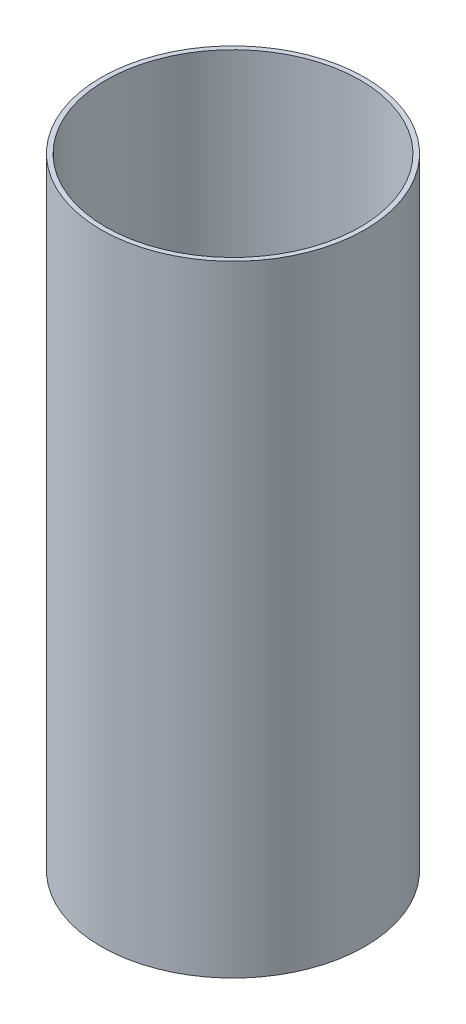
ISO-10303-21;
HEADER;
FILE_DESCRIPTION(('STEP AP214'),'2;1');
FILE_NAME('part.step','',(''),(''),'','','');
FILE_SCHEMA(('AUTOMOTIVE_DESIGN { 1 0 10303 214 1 1 1 1 }'));
ENDSEC;
DATA;
#1=APPLICATION_CONTEXT('core data for automotive mechanical design processes');
#2=APPLICATION_PROTOCOL_DEFINITION('international standard','automotive_design',2000,#1);
#3=PRODUCT_CONTEXT('',#1,'mechanical');
#4=PRODUCT('Part','Part','',(#3));
#5=PRODUCT_RELATED_PRODUCT_CATEGORY('part','',(#4));
#6=PRODUCT_DEFINITION_FORMATION('','',#4);
#7=PRODUCT_DEFINITION_CONTEXT('part definition',#1,'design');
#8=PRODUCT_DEFINITION('design','',#6,#7);
#9=PRODUCT_DEFINITION_SHAPE('','',#8);
#10=(LENGTH_UNIT() NAMED_UNIT(*) SI_UNIT(.MILLI.,.METRE.));
#11=(NAMED_UNIT(*) PLANE_ANGLE_UNIT() SI_UNIT($,.RADIAN.));
#12=(NAMED_UNIT(*) SI_UNIT($,.STERADIAN.) SOLID_ANGLE_UNIT());
#13=UNCERTAINTY_MEASURE_WITH_UNIT(LENGTH_MEASURE(1.E-05),#10,'distance_accuracy_value','');
#14=(GEOMETRIC_REPRESENTATION_CONTEXT(3) GLOBAL_UNCERTAINTY_ASSIGNED_CONTEXT((#13)) GLOBAL_UNIT_ASSIGNED_CONTEXT((#10,
#11,#12)) REPRESENTATION_CONTEXT('',''));
#15=CARTESIAN_POINT('',(0.,0.,0.));
#16=DIRECTION('',(0.,0.,1.));
#17=DIRECTION('',(1.,0.,0.));
#18=AXIS2_PLACEMENT_3D('',#15,#16,#17);
#19=CARTESIAN_POINT('',(0.,200.,0.));
#20=DIRECTION('',(0.,1.,0.));
#21=DIRECTION('',(0.,0.,1.));
#22=AXIS2_PLACEMENT_3D('',#19,#20,#21);
#23=PLANE('',#22);
#24=CARTESIAN_POINT('',(0.,200.,0.));
#25=DIRECTION('',(0.,1.,0.));
#26=DIRECTION('',(0.,0.,1.));
#27=AXIS2_PLACEMENT_3D('',#24,#25,#26);
#28=CIRCLE('',#27,42.5);
#29=CARTESIAN_POINT('',(0.,200.,42.5));
#30=VERTEX_POINT('',#29);
#31=EDGE_CURVE('E10',#30,#30,#28,.T.);
#32=ORIENTED_EDGE('',*,*,#31,.T.);
#33=EDGE_LOOP('',(#32));
#34=FACE_BOUND('',#33,.T.);
#35=CARTESIAN_POINT('',(0.,200.,0.));
#36=DIRECTION('',(0.,1.,0.));
#37=DIRECTION('',(0.,0.,1.));
#38=AXIS2_PLACEMENT_3D('',#35,#36,#37);
#39=CIRCLE('',#38,41.);
#40=CARTESIAN_POINT('',(0.,200.,41.));
#41=VERTEX_POINT('',#40);
#42=EDGE_CURVE('E48',#41,#41,#39,.T.);
#43=ORIENTED_EDGE('',*,*,#42,.F.);
#44=EDGE_LOOP('',(#43));
#45=FACE_BOUND('',#44,.T.);
#46=ADVANCED_FACE('F37',(#34,#45),#23,.T.);
#47=CARTESIAN_POINT('',(0.,0.,0.));
#48=DIRECTION('',(0.,1.,0.));
#49=DIRECTION('',(0.,0.,1.));
#50=AXIS2_PLACEMENT_3D('',#47,#48,#49);
#51=PLANE('',#50);
#52=CARTESIAN_POINT('',(0.,0.,0.));
#53=DIRECTION('',(0.,1.,0.));
#54=DIRECTION('',(0.,0.,1.));
#55=AXIS2_PLACEMENT_3D('',#52,#53,#54);
#56=CIRCLE('',#55,42.5);
#57=CARTESIAN_POINT('',(0.,0.,42.5));
#58=VERTEX_POINT('',#57);
#59=EDGE_CURVE('E41',#58,#58,#56,.T.);
#60=ORIENTED_EDGE('',*,*,#59,.F.);
#61=EDGE_LOOP('',(#60));
#62=FACE_BOUND('',#61,.T.);
#63=CARTESIAN_POINT('',(0.,0.,0.));
#64=DIRECTION('',(0.,1.,0.));
#65=DIRECTION('',(0.,0.,1.));
#66=AXIS2_PLACEMENT_3D('',#63,#64,#65);
#67=CIRCLE('',#66,41.);
#68=CARTESIAN_POINT('',(0.,0.,41.));
#69=VERTEX_POINT('',#68);
#70=EDGE_CURVE('E50',#69,#69,#67,.T.);
#71=ORIENTED_EDGE('',*,*,#70,.T.);
#72=EDGE_LOOP('',(#71));
#73=FACE_BOUND('',#72,.T.);
#74=ADVANCED_FACE('F60',(#62,#73),#51,.F.);
#75=CARTESIAN_POINT('',(0.,200.,0.));
#76=DIRECTION('',(0.,-1.,0.));
#77=DIRECTION('',(0.,0.,-1.));
#78=AXIS2_PLACEMENT_3D('',#75,#76,#77);
#79=CYLINDRICAL_SURFACE('',#78,42.5);
#80=ORIENTED_EDGE('',*,*,#31,.F.);
#81=EDGE_LOOP('',(#80));
#82=FACE_BOUND('',#81,.T.);
#83=ORIENTED_EDGE('',*,*,#59,.T.);
#84=EDGE_LOOP('',(#83));
#85=FACE_BOUND('',#84,.T.);
#86=ADVANCED_FACE('F39',(#82,#85),#79,.T.);
#87=CARTESIAN_POINT('',(0.,200.,0.));
#88=DIRECTION('',(0.,-1.,0.));
#89=DIRECTION('',(0.,0.,-1.));
#90=AXIS2_PLACEMENT_3D('',#87,#88,#89);
#91=CYLINDRICAL_SURFACE('',#90,41.);
#92=ORIENTED_EDGE('',*,*,#42,.T.);
#93=EDGE_LOOP('',(#92));
#94=FACE_BOUND('',#93,.T.);
#95=ORIENTED_EDGE('',*,*,#70,.F.);
#96=EDGE_LOOP('',(#95));
#97=FACE_BOUND('',#96,.T.);
#98=ADVANCED_FACE('F56',(#94,#97),#91,.F.);
#99=CLOSED_SHELL('',(#46,#74,#86,#98));
#100=MANIFOLD_SOLID_BREP('B2',#99);
#101=ADVANCED_BREP_SHAPE_REPRESENTATION('',(#18,#100),#14);
#102=SHAPE_DEFINITION_REPRESENTATION(#9,#101);
ENDSEC;
END-ISO-10303-21;
